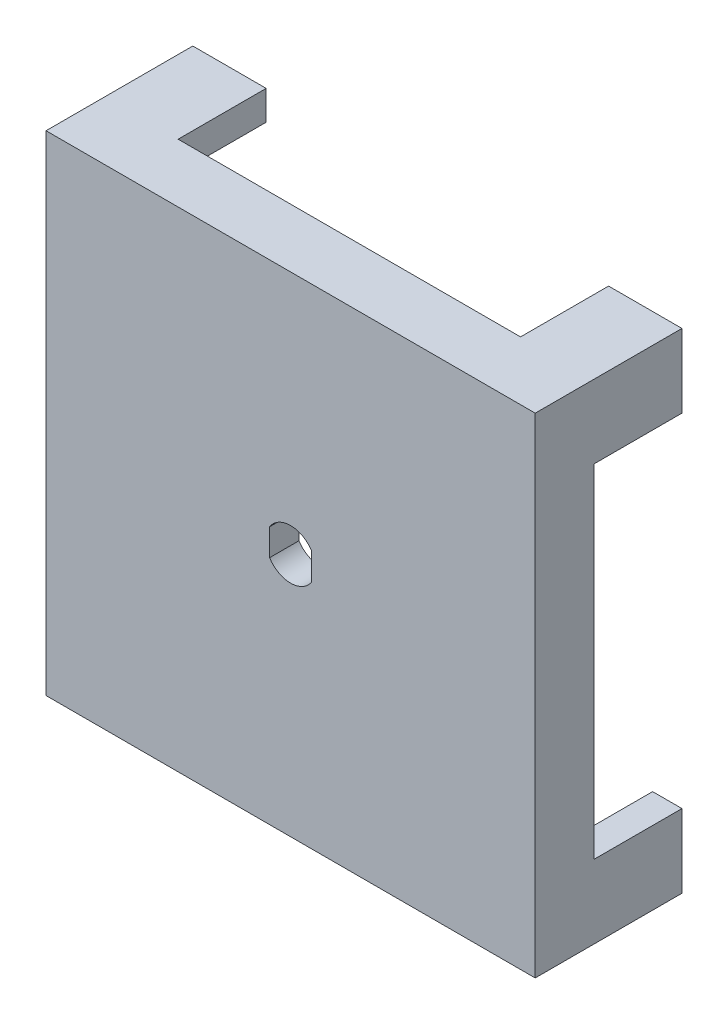
ISO-10303-21;
HEADER;
FILE_DESCRIPTION(('STEP AP214'),'2;1');
FILE_NAME('part.step','',(''),(''),'','','');
FILE_SCHEMA(('AUTOMOTIVE_DESIGN { 1 0 10303 214 1 1 1 1 }'));
ENDSEC;
DATA;
#1=APPLICATION_CONTEXT('core data for automotive mechanical design processes');
#2=APPLICATION_PROTOCOL_DEFINITION('international standard','automotive_design',2000,#1);
#3=PRODUCT_CONTEXT('',#1,'mechanical');
#4=PRODUCT('Part','Part','',(#3));
#5=PRODUCT_RELATED_PRODUCT_CATEGORY('part','',(#4));
#6=PRODUCT_DEFINITION_FORMATION('','',#4);
#7=PRODUCT_DEFINITION_CONTEXT('part definition',#1,'design');
#8=PRODUCT_DEFINITION('design','',#6,#7);
#9=PRODUCT_DEFINITION_SHAPE('','',#8);
#10=(LENGTH_UNIT() NAMED_UNIT(*) SI_UNIT(.MILLI.,.METRE.));
#11=(NAMED_UNIT(*) PLANE_ANGLE_UNIT() SI_UNIT($,.RADIAN.));
#12=(NAMED_UNIT(*) SI_UNIT($,.STERADIAN.) SOLID_ANGLE_UNIT());
#13=UNCERTAINTY_MEASURE_WITH_UNIT(LENGTH_MEASURE(1.E-05),#10,'distance_accuracy_value','');
#14=(GEOMETRIC_REPRESENTATION_CONTEXT(3) GLOBAL_UNCERTAINTY_ASSIGNED_CONTEXT((#13)) GLOBAL_UNIT_ASSIGNED_CONTEXT((#10,
#11,#12)) REPRESENTATION_CONTEXT('',''));
#15=CARTESIAN_POINT('',(0.,0.,0.));
#16=DIRECTION('',(0.,0.,1.));
#17=DIRECTION('',(1.,0.,0.));
#18=AXIS2_PLACEMENT_3D('',#15,#16,#17);
#19=CARTESIAN_POINT('',(0.,0.,0.));
#20=DIRECTION('',(0.,0.,-1.));
#21=DIRECTION('',(-1.,0.,0.));
#22=AXIS2_PLACEMENT_3D('',#19,#20,#21);
#23=PLANE('',#22);
#24=DIRECTION('',(1.,0.,0.));
#25=VECTOR('',#24,1.);
#26=CARTESIAN_POINT('',(17.5,17.5,0.));
#27=LINE('',#26,#25);
#28=CARTESIAN_POINT('',(22.,17.5,0.));
#29=VERTEX_POINT('',#28);
#30=CARTESIAN_POINT('',(25.,17.5,0.));
#31=VERTEX_POINT('',#30);
#32=EDGE_CURVE('E224',#29,#31,#27,.T.);
#33=ORIENTED_EDGE('',*,*,#32,.F.);
#34=DIRECTION('',(0.,1.,0.));
#35=VECTOR('',#34,1.);
#36=CARTESIAN_POINT('',(22.,0.,0.));
#37=LINE('',#36,#35);
#38=CARTESIAN_POINT('',(22.,22.,0.));
#39=VERTEX_POINT('',#38);
#40=EDGE_CURVE('E234',#29,#39,#37,.T.);
#41=ORIENTED_EDGE('',*,*,#40,.T.);
#42=DIRECTION('',(-1.,0.,0.));
#43=VECTOR('',#42,1.);
#44=CARTESIAN_POINT('',(0.,22.,0.));
#45=LINE('',#44,#43);
#46=CARTESIAN_POINT('',(17.5,22.,0.));
#47=VERTEX_POINT('',#46);
#48=EDGE_CURVE('E266',#39,#47,#45,.T.);
#49=ORIENTED_EDGE('',*,*,#48,.T.);
#50=DIRECTION('',(0.,-1.,0.));
#51=VECTOR('',#50,1.);
#52=CARTESIAN_POINT('',(17.5,17.5,0.));
#53=LINE('',#52,#51);
#54=CARTESIAN_POINT('',(17.5,25.,0.));
#55=VERTEX_POINT('',#54);
#56=EDGE_CURVE('E460',#55,#47,#53,.T.);
#57=ORIENTED_EDGE('',*,*,#56,.F.);
#58=DIRECTION('',(-1.,0.,0.));
#59=VECTOR('',#58,1.);
#60=CARTESIAN_POINT('',(-25.,25.,0.));
#61=LINE('',#60,#59);
#62=CARTESIAN_POINT('',(25.,25.,0.));
#63=VERTEX_POINT('',#62);
#64=EDGE_CURVE('E283',#63,#55,#61,.T.);
#65=ORIENTED_EDGE('',*,*,#64,.F.);
#66=DIRECTION('',(0.,1.,0.));
#67=VECTOR('',#66,1.);
#68=CARTESIAN_POINT('',(25.,-25.,0.));
#69=LINE('',#68,#67);
#70=EDGE_CURVE('E237',#31,#63,#69,.T.);
#71=ORIENTED_EDGE('',*,*,#70,.F.);
#72=EDGE_LOOP('',(#33,#41,#49,#57,#65,#71));
#73=FACE_BOUND('',#72,.T.);
#74=ADVANCED_FACE('F38',(#73),#23,.T.);
#75=DIRECTION('',(0.,1.,0.));
#76=VECTOR('',#75,1.);
#77=CARTESIAN_POINT('',(-17.5,17.5,0.));
#78=LINE('',#77,#76);
#79=CARTESIAN_POINT('',(-17.5,22.,0.));
#80=VERTEX_POINT('',#79);
#81=CARTESIAN_POINT('',(-17.5,25.,0.));
#82=VERTEX_POINT('',#81);
#83=EDGE_CURVE('E436',#80,#82,#78,.T.);
#84=ORIENTED_EDGE('',*,*,#83,.F.);
#85=CARTESIAN_POINT('',(-22.,22.,0.));
#86=VERTEX_POINT('',#85);
#87=EDGE_CURVE('E249',#80,#86,#45,.T.);
#88=ORIENTED_EDGE('',*,*,#87,.T.);
#89=DIRECTION('',(0.,-1.,0.));
#90=VECTOR('',#89,1.);
#91=CARTESIAN_POINT('',(-22.,0.,0.));
#92=LINE('',#91,#90);
#93=CARTESIAN_POINT('',(-22.,17.5,0.));
#94=VERTEX_POINT('',#93);
#95=EDGE_CURVE('E262',#86,#94,#92,.T.);
#96=ORIENTED_EDGE('',*,*,#95,.T.);
#97=DIRECTION('',(1.,0.,0.));
#98=VECTOR('',#97,1.);
#99=CARTESIAN_POINT('',(-26.9414519116129,17.5,0.));
#100=LINE('',#99,#98);
#101=CARTESIAN_POINT('',(-25.,17.5,0.));
#102=VERTEX_POINT('',#101);
#103=EDGE_CURVE('E434',#102,#94,#100,.T.);
#104=ORIENTED_EDGE('',*,*,#103,.F.);
#105=DIRECTION('',(0.,-1.,0.));
#106=VECTOR('',#105,1.);
#107=CARTESIAN_POINT('',(-25.,-25.,0.));
#108=LINE('',#107,#106);
#109=CARTESIAN_POINT('',(-25.,25.,0.));
#110=VERTEX_POINT('',#109);
#111=EDGE_CURVE('E287',#110,#102,#108,.T.);
#112=ORIENTED_EDGE('',*,*,#111,.F.);
#113=EDGE_CURVE('E282',#82,#110,#61,.T.);
#114=ORIENTED_EDGE('',*,*,#113,.F.);
#115=EDGE_LOOP('',(#84,#88,#96,#104,#112,#114));
#116=FACE_BOUND('',#115,.T.);
#117=ADVANCED_FACE('F432',(#116),#23,.T.);
#118=DIRECTION('',(-1.,0.,0.));
#119=VECTOR('',#118,1.);
#120=CARTESIAN_POINT('',(-26.9414519116129,-17.5,0.));
#121=LINE('',#120,#119);
#122=CARTESIAN_POINT('',(-22.,-17.5,0.));
#123=VERTEX_POINT('',#122);
#124=CARTESIAN_POINT('',(-25.,-17.5,0.));
#125=VERTEX_POINT('',#124);
#126=EDGE_CURVE('E456',#123,#125,#121,.T.);
#127=ORIENTED_EDGE('',*,*,#126,.F.);
#128=CARTESIAN_POINT('',(-22.,-22.,0.));
#129=VERTEX_POINT('',#128);
#130=EDGE_CURVE('E265',#123,#129,#92,.T.);
#131=ORIENTED_EDGE('',*,*,#130,.T.);
#132=DIRECTION('',(1.,0.,0.));
#133=VECTOR('',#132,1.);
#134=CARTESIAN_POINT('',(0.,-22.,0.));
#135=LINE('',#134,#133);
#136=CARTESIAN_POINT('',(-17.5,-22.,0.));
#137=VERTEX_POINT('',#136);
#138=EDGE_CURVE('E257',#129,#137,#135,.T.);
#139=ORIENTED_EDGE('',*,*,#138,.T.);
#140=DIRECTION('',(0.,1.,0.));
#141=VECTOR('',#140,1.);
#142=CARTESIAN_POINT('',(-17.5,-27.9483997174268,0.));
#143=LINE('',#142,#141);
#144=CARTESIAN_POINT('',(-17.5,-25.,0.));
#145=VERTEX_POINT('',#144);
#146=EDGE_CURVE('E454',#145,#137,#143,.T.);
#147=ORIENTED_EDGE('',*,*,#146,.F.);
#148=DIRECTION('',(1.,0.,0.));
#149=VECTOR('',#148,1.);
#150=CARTESIAN_POINT('',(-25.,-25.,0.));
#151=LINE('',#150,#149);
#152=CARTESIAN_POINT('',(-25.,-25.,0.));
#153=VERTEX_POINT('',#152);
#154=EDGE_CURVE('E272',#153,#145,#151,.T.);
#155=ORIENTED_EDGE('',*,*,#154,.F.);
#156=EDGE_CURVE('E286',#125,#153,#108,.T.);
#157=ORIENTED_EDGE('',*,*,#156,.F.);
#158=EDGE_LOOP('',(#127,#131,#139,#147,#155,#157));
#159=FACE_BOUND('',#158,.T.);
#160=ADVANCED_FACE('F473',(#159),#23,.T.);
#161=DIRECTION('',(0.,-1.,0.));
#162=VECTOR('',#161,1.);
#163=CARTESIAN_POINT('',(17.5,-27.9483997174268,0.));
#164=LINE('',#163,#162);
#165=CARTESIAN_POINT('',(17.5,-22.,0.));
#166=VERTEX_POINT('',#165);
#167=CARTESIAN_POINT('',(17.5,-25.,0.));
#168=VERTEX_POINT('',#167);
#169=EDGE_CURVE('E452',#166,#168,#164,.T.);
#170=ORIENTED_EDGE('',*,*,#169,.F.);
#171=CARTESIAN_POINT('',(22.,-22.,0.));
#172=VERTEX_POINT('',#171);
#173=EDGE_CURVE('E261',#166,#172,#135,.T.);
#174=ORIENTED_EDGE('',*,*,#173,.T.);
#175=CARTESIAN_POINT('',(22.,-17.5,0.));
#176=VERTEX_POINT('',#175);
#177=EDGE_CURVE('E245',#172,#176,#37,.T.);
#178=ORIENTED_EDGE('',*,*,#177,.T.);
#179=DIRECTION('',(-1.,0.,0.));
#180=VECTOR('',#179,1.);
#181=CARTESIAN_POINT('',(17.5,-17.5,0.));
#182=LINE('',#181,#180);
#183=CARTESIAN_POINT('',(25.,-17.5,0.));
#184=VERTEX_POINT('',#183);
#185=EDGE_CURVE('E238',#184,#176,#182,.T.);
#186=ORIENTED_EDGE('',*,*,#185,.F.);
#187=CARTESIAN_POINT('',(25.,-25.,0.));
#188=VERTEX_POINT('',#187);
#189=EDGE_CURVE('E279',#188,#184,#69,.T.);
#190=ORIENTED_EDGE('',*,*,#189,.F.);
#191=EDGE_CURVE('E290',#168,#188,#151,.T.);
#192=ORIENTED_EDGE('',*,*,#191,.F.);
#193=EDGE_LOOP('',(#170,#174,#178,#186,#190,#192));
#194=FACE_BOUND('',#193,.T.);
#195=ADVANCED_FACE('F495',(#194),#23,.T.);
#196=CARTESIAN_POINT('',(25.,-25.,15.));
#197=DIRECTION('',(-1.,0.,0.));
#198=DIRECTION('',(0.,0.,1.));
#199=AXIS2_PLACEMENT_3D('',#196,#197,#198);
#200=PLANE('',#199);
#201=DIRECTION('',(0.,1.,0.));
#202=VECTOR('',#201,1.);
#203=CARTESIAN_POINT('',(25.,-25.,9.));
#204=LINE('',#203,#202);
#205=CARTESIAN_POINT('',(25.,-17.5,9.));
#206=VERTEX_POINT('',#205);
#207=CARTESIAN_POINT('',(25.,17.5,9.));
#208=VERTEX_POINT('',#207);
#209=EDGE_CURVE('E350',#206,#208,#204,.T.);
#210=ORIENTED_EDGE('',*,*,#209,.T.);
#211=DIRECTION('',(0.,0.,-1.));
#212=VECTOR('',#211,1.);
#213=CARTESIAN_POINT('',(25.,17.5,15.));
#214=LINE('',#213,#212);
#215=EDGE_CURVE('E373',#208,#31,#214,.T.);
#216=ORIENTED_EDGE('',*,*,#215,.T.);
#217=ORIENTED_EDGE('',*,*,#70,.T.);
#218=DIRECTION('',(0.,0.,-1.));
#219=VECTOR('',#218,1.);
#220=CARTESIAN_POINT('',(25.,25.,15.));
#221=LINE('',#220,#219);
#222=CARTESIAN_POINT('',(25.,25.,15.));
#223=VERTEX_POINT('',#222);
#224=EDGE_CURVE('E301',#223,#63,#221,.T.);
#225=ORIENTED_EDGE('',*,*,#224,.F.);
#226=DIRECTION('',(0.,1.,0.));
#227=VECTOR('',#226,1.);
#228=CARTESIAN_POINT('',(25.,-25.,15.));
#229=LINE('',#228,#227);
#230=CARTESIAN_POINT('',(25.,-25.,15.));
#231=VERTEX_POINT('',#230);
#232=EDGE_CURVE('E268',#231,#223,#229,.T.);
#233=ORIENTED_EDGE('',*,*,#232,.F.);
#234=DIRECTION('',(0.,0.,-1.));
#235=VECTOR('',#234,1.);
#236=CARTESIAN_POINT('',(25.,-25.,15.));
#237=LINE('',#236,#235);
#238=EDGE_CURVE('E278',#231,#188,#237,.T.);
#239=ORIENTED_EDGE('',*,*,#238,.T.);
#240=ORIENTED_EDGE('',*,*,#189,.T.);
#241=DIRECTION('',(0.,0.,1.));
#242=VECTOR('',#241,1.);
#243=CARTESIAN_POINT('',(25.,-17.5,15.));
#244=LINE('',#243,#242);
#245=EDGE_CURVE('E371',#184,#206,#244,.T.);
#246=ORIENTED_EDGE('',*,*,#245,.T.);
#247=EDGE_LOOP('',(#210,#216,#217,#225,#233,#239,#240,#246));
#248=FACE_BOUND('',#247,.T.);
#249=ADVANCED_FACE('F40',(#248),#200,.F.);
#250=CARTESIAN_POINT('',(-25.,25.,15.));
#251=DIRECTION('',(0.,-1.,0.));
#252=DIRECTION('',(0.,0.,-1.));
#253=AXIS2_PLACEMENT_3D('',#250,#251,#252);
#254=PLANE('',#253);
#255=ORIENTED_EDGE('',*,*,#64,.T.);
#256=DIRECTION('',(0.,0.,1.));
#257=VECTOR('',#256,1.);
#258=CARTESIAN_POINT('',(17.5,25.,15.));
#259=LINE('',#258,#257);
#260=CARTESIAN_POINT('',(17.5,25.,9.));
#261=VERTEX_POINT('',#260);
#262=EDGE_CURVE('E368',#55,#261,#259,.T.);
#263=ORIENTED_EDGE('',*,*,#262,.T.);
#264=DIRECTION('',(-1.,0.,0.));
#265=VECTOR('',#264,1.);
#266=CARTESIAN_POINT('',(-25.,25.,9.));
#267=LINE('',#266,#265);
#268=CARTESIAN_POINT('',(-17.5,25.,9.));
#269=VERTEX_POINT('',#268);
#270=EDGE_CURVE('E347',#261,#269,#267,.T.);
#271=ORIENTED_EDGE('',*,*,#270,.T.);
#272=DIRECTION('',(0.,0.,-1.));
#273=VECTOR('',#272,1.);
#274=CARTESIAN_POINT('',(-17.5,25.,15.));
#275=LINE('',#274,#273);
#276=EDGE_CURVE('E365',#269,#82,#275,.T.);
#277=ORIENTED_EDGE('',*,*,#276,.T.);
#278=ORIENTED_EDGE('',*,*,#113,.T.);
#279=DIRECTION('',(0.,0.,-1.));
#280=VECTOR('',#279,1.);
#281=CARTESIAN_POINT('',(-25.,25.,15.));
#282=LINE('',#281,#280);
#283=CARTESIAN_POINT('',(-25.,25.,15.));
#284=VERTEX_POINT('',#283);
#285=EDGE_CURVE('E298',#284,#110,#282,.T.);
#286=ORIENTED_EDGE('',*,*,#285,.F.);
#287=DIRECTION('',(-1.,0.,0.));
#288=VECTOR('',#287,1.);
#289=CARTESIAN_POINT('',(-25.,25.,15.));
#290=LINE('',#289,#288);
#291=EDGE_CURVE('E271',#223,#284,#290,.T.);
#292=ORIENTED_EDGE('',*,*,#291,.F.);
#293=ORIENTED_EDGE('',*,*,#224,.T.);
#294=EDGE_LOOP('',(#255,#263,#271,#277,#278,#286,#292,#293));
#295=FACE_BOUND('',#294,.T.);
#296=ADVANCED_FACE('F507',(#295),#254,.F.);
#297=CARTESIAN_POINT('',(-25.,-25.,15.));
#298=DIRECTION('',(1.,0.,0.));
#299=DIRECTION('',(0.,0.,-1.));
#300=AXIS2_PLACEMENT_3D('',#297,#298,#299);
#301=PLANE('',#300);
#302=ORIENTED_EDGE('',*,*,#111,.T.);
#303=DIRECTION('',(0.,0.,1.));
#304=VECTOR('',#303,1.);
#305=CARTESIAN_POINT('',(-25.,17.5,15.));
#306=LINE('',#305,#304);
#307=CARTESIAN_POINT('',(-25.,17.5,9.));
#308=VERTEX_POINT('',#307);
#309=EDGE_CURVE('E362',#102,#308,#306,.T.);
#310=ORIENTED_EDGE('',*,*,#309,.T.);
#311=DIRECTION('',(0.,-1.,0.));
#312=VECTOR('',#311,1.);
#313=CARTESIAN_POINT('',(-25.,-25.,9.));
#314=LINE('',#313,#312);
#315=CARTESIAN_POINT('',(-25.,-17.5,9.));
#316=VERTEX_POINT('',#315);
#317=EDGE_CURVE('E339',#308,#316,#314,.T.);
#318=ORIENTED_EDGE('',*,*,#317,.T.);
#319=DIRECTION('',(0.,0.,-1.));
#320=VECTOR('',#319,1.);
#321=CARTESIAN_POINT('',(-25.,-17.5,15.));
#322=LINE('',#321,#320);
#323=EDGE_CURVE('E359',#316,#125,#322,.T.);
#324=ORIENTED_EDGE('',*,*,#323,.T.);
#325=ORIENTED_EDGE('',*,*,#156,.T.);
#326=DIRECTION('',(0.,0.,-1.));
#327=VECTOR('',#326,1.);
#328=CARTESIAN_POINT('',(-25.,-25.,15.));
#329=LINE('',#328,#327);
#330=CARTESIAN_POINT('',(-25.,-25.,15.));
#331=VERTEX_POINT('',#330);
#332=EDGE_CURVE('E295',#331,#153,#329,.T.);
#333=ORIENTED_EDGE('',*,*,#332,.F.);
#334=DIRECTION('',(0.,-1.,0.));
#335=VECTOR('',#334,1.);
#336=CARTESIAN_POINT('',(-25.,-25.,15.));
#337=LINE('',#336,#335);
#338=EDGE_CURVE('E274',#284,#331,#337,.T.);
#339=ORIENTED_EDGE('',*,*,#338,.F.);
#340=ORIENTED_EDGE('',*,*,#285,.T.);
#341=EDGE_LOOP('',(#302,#310,#318,#324,#325,#333,#339,#340));
#342=FACE_BOUND('',#341,.T.);
#343=ADVANCED_FACE('F478',(#342),#301,.F.);
#344=CARTESIAN_POINT('',(-25.,-25.,15.));
#345=DIRECTION('',(0.,1.,0.));
#346=DIRECTION('',(0.,0.,1.));
#347=AXIS2_PLACEMENT_3D('',#344,#345,#346);
#348=PLANE('',#347);
#349=ORIENTED_EDGE('',*,*,#154,.T.);
#350=DIRECTION('',(0.,0.,1.));
#351=VECTOR('',#350,1.);
#352=CARTESIAN_POINT('',(-17.5,-25.,15.));
#353=LINE('',#352,#351);
#354=CARTESIAN_POINT('',(-17.5,-25.,9.));
#355=VERTEX_POINT('',#354);
#356=EDGE_CURVE('E356',#145,#355,#353,.T.);
#357=ORIENTED_EDGE('',*,*,#356,.T.);
#358=DIRECTION('',(1.,0.,0.));
#359=VECTOR('',#358,1.);
#360=CARTESIAN_POINT('',(-25.,-25.,9.));
#361=LINE('',#360,#359);
#362=CARTESIAN_POINT('',(17.5,-25.,9.));
#363=VERTEX_POINT('',#362);
#364=EDGE_CURVE('E335',#355,#363,#361,.T.);
#365=ORIENTED_EDGE('',*,*,#364,.T.);
#366=DIRECTION('',(0.,0.,-1.));
#367=VECTOR('',#366,1.);
#368=CARTESIAN_POINT('',(17.5,-25.,15.));
#369=LINE('',#368,#367);
#370=EDGE_CURVE('E353',#363,#168,#369,.T.);
#371=ORIENTED_EDGE('',*,*,#370,.T.);
#372=ORIENTED_EDGE('',*,*,#191,.T.);
#373=ORIENTED_EDGE('',*,*,#238,.F.);
#374=DIRECTION('',(1.,0.,0.));
#375=VECTOR('',#374,1.);
#376=CARTESIAN_POINT('',(-25.,-25.,15.));
#377=LINE('',#376,#375);
#378=EDGE_CURVE('E276',#331,#231,#377,.T.);
#379=ORIENTED_EDGE('',*,*,#378,.F.);
#380=ORIENTED_EDGE('',*,*,#332,.T.);
#381=EDGE_LOOP('',(#349,#357,#365,#371,#372,#373,#379,#380));
#382=FACE_BOUND('',#381,.T.);
#383=ADVANCED_FACE('F529',(#382),#348,.F.);
#384=CARTESIAN_POINT('',(0.,0.,15.));
#385=DIRECTION('',(0.,0.,-1.));
#386=DIRECTION('',(-1.,0.,0.));
#387=AXIS2_PLACEMENT_3D('',#384,#385,#386);
#388=PLANE('',#387);
#389=DIRECTION('',(0.,1.,0.));
#390=VECTOR('',#389,1.);
#391=CARTESIAN_POINT('',(-2.15,1.37113092008021,15.));
#392=LINE('',#391,#390);
#393=CARTESIAN_POINT('',(-2.15,-1.37113092008021,15.));
#394=VERTEX_POINT('',#393);
#395=CARTESIAN_POINT('',(-2.15,1.37113092008021,15.));
#396=VERTEX_POINT('',#395);
#397=EDGE_CURVE('E384',#394,#396,#392,.T.);
#398=ORIENTED_EDGE('',*,*,#397,.T.);
#399=CARTESIAN_POINT('',(0.,0.,15.));
#400=DIRECTION('',(0.,0.,-1.));
#401=DIRECTION('',(-1.,0.,0.));
#402=AXIS2_PLACEMENT_3D('',#399,#400,#401);
#403=CIRCLE('',#402,2.55);
#404=CARTESIAN_POINT('',(2.15,1.37113092008021,15.));
#405=VERTEX_POINT('',#404);
#406=EDGE_CURVE('E375',#396,#405,#403,.T.);
#407=ORIENTED_EDGE('',*,*,#406,.T.);
#408=DIRECTION('',(0.,-1.,0.));
#409=VECTOR('',#408,1.);
#410=CARTESIAN_POINT('',(2.15,1.37113092008021,15.));
#411=LINE('',#410,#409);
#412=CARTESIAN_POINT('',(2.15,-1.37113092008021,15.));
#413=VERTEX_POINT('',#412);
#414=EDGE_CURVE('E378',#405,#413,#411,.T.);
#415=ORIENTED_EDGE('',*,*,#414,.T.);
#416=CARTESIAN_POINT('',(0.,0.,15.));
#417=DIRECTION('',(0.,0.,-1.));
#418=DIRECTION('',(-1.,0.,0.));
#419=AXIS2_PLACEMENT_3D('',#416,#417,#418);
#420=CIRCLE('',#419,2.55);
#421=EDGE_CURVE('E381',#413,#394,#420,.T.);
#422=ORIENTED_EDGE('',*,*,#421,.T.);
#423=EDGE_LOOP('',(#398,#407,#415,#422));
#424=FACE_BOUND('',#423,.T.);
#425=ORIENTED_EDGE('',*,*,#232,.T.);
#426=ORIENTED_EDGE('',*,*,#291,.T.);
#427=ORIENTED_EDGE('',*,*,#338,.T.);
#428=ORIENTED_EDGE('',*,*,#378,.T.);
#429=EDGE_LOOP('',(#425,#426,#427,#428));
#430=FACE_BOUND('',#429,.T.);
#431=ADVANCED_FACE('F537',(#424,#430),#388,.F.);
#432=CARTESIAN_POINT('',(22.,-25.,15.));
#433=DIRECTION('',(-1.,0.,0.));
#434=DIRECTION('',(0.,0.,1.));
#435=AXIS2_PLACEMENT_3D('',#432,#433,#434);
#436=PLANE('',#435);
#437=DIRECTION('',(0.,0.,-1.));
#438=VECTOR('',#437,1.);
#439=CARTESIAN_POINT('',(22.,17.5,15.));
#440=LINE('',#439,#438);
#441=CARTESIAN_POINT('',(22.,17.5,9.));
#442=VERTEX_POINT('',#441);
#443=EDGE_CURVE('E11',#442,#29,#440,.T.);
#444=ORIENTED_EDGE('',*,*,#443,.F.);
#445=DIRECTION('',(0.,1.,0.));
#446=VECTOR('',#445,1.);
#447=CARTESIAN_POINT('',(22.,-25.,9.));
#448=LINE('',#447,#446);
#449=CARTESIAN_POINT('',(22.,-17.5,9.));
#450=VERTEX_POINT('',#449);
#451=EDGE_CURVE('E334',#450,#442,#448,.T.);
#452=ORIENTED_EDGE('',*,*,#451,.F.);
#453=DIRECTION('',(0.,0.,1.));
#454=VECTOR('',#453,1.);
#455=CARTESIAN_POINT('',(22.,-17.5,15.));
#456=LINE('',#455,#454);
#457=EDGE_CURVE('E46',#176,#450,#456,.T.);
#458=ORIENTED_EDGE('',*,*,#457,.F.);
#459=ORIENTED_EDGE('',*,*,#177,.F.);
#460=DIRECTION('',(0.,0.,-1.));
#461=VECTOR('',#460,1.);
#462=CARTESIAN_POINT('',(22.,-22.,15.));
#463=LINE('',#462,#461);
#464=CARTESIAN_POINT('',(22.,-22.,12.));
#465=VERTEX_POINT('',#464);
#466=EDGE_CURVE('E398',#465,#172,#463,.T.);
#467=ORIENTED_EDGE('',*,*,#466,.F.);
#468=DIRECTION('',(0.,1.,0.));
#469=VECTOR('',#468,1.);
#470=CARTESIAN_POINT('',(22.,0.,12.));
#471=LINE('',#470,#469);
#472=CARTESIAN_POINT('',(22.,22.,12.));
#473=VERTEX_POINT('',#472);
#474=EDGE_CURVE('E260',#465,#473,#471,.T.);
#475=ORIENTED_EDGE('',*,*,#474,.T.);
#476=DIRECTION('',(0.,0.,-1.));
#477=VECTOR('',#476,1.);
#478=CARTESIAN_POINT('',(22.,22.,15.));
#479=LINE('',#478,#477);
#480=EDGE_CURVE('E244',#473,#39,#479,.T.);
#481=ORIENTED_EDGE('',*,*,#480,.T.);
#482=ORIENTED_EDGE('',*,*,#40,.F.);
#483=EDGE_LOOP('',(#444,#452,#458,#459,#467,#475,#481,#482));
#484=FACE_BOUND('',#483,.T.);
#485=ADVANCED_FACE('F241',(#484),#436,.T.);
#486=CARTESIAN_POINT('',(-25.,22.,15.));
#487=DIRECTION('',(0.,-1.,0.));
#488=DIRECTION('',(0.,0.,-1.));
#489=AXIS2_PLACEMENT_3D('',#486,#487,#488);
#490=PLANE('',#489);
#491=DIRECTION('',(0.,0.,1.));
#492=VECTOR('',#491,1.);
#493=CARTESIAN_POINT('',(17.5,22.,15.));
#494=LINE('',#493,#492);
#495=CARTESIAN_POINT('',(17.5,22.,9.));
#496=VERTEX_POINT('',#495);
#497=EDGE_CURVE('E327',#47,#496,#494,.T.);
#498=ORIENTED_EDGE('',*,*,#497,.F.);
#499=ORIENTED_EDGE('',*,*,#48,.F.);
#500=ORIENTED_EDGE('',*,*,#480,.F.);
#501=DIRECTION('',(-1.,0.,0.));
#502=VECTOR('',#501,1.);
#503=CARTESIAN_POINT('',(0.,22.,12.));
#504=LINE('',#503,#502);
#505=CARTESIAN_POINT('',(-22.,22.,12.));
#506=VERTEX_POINT('',#505);
#507=EDGE_CURVE('E397',#473,#506,#504,.T.);
#508=ORIENTED_EDGE('',*,*,#507,.T.);
#509=DIRECTION('',(0.,0.,-1.));
#510=VECTOR('',#509,1.);
#511=CARTESIAN_POINT('',(-22.,22.,15.));
#512=LINE('',#511,#510);
#513=EDGE_CURVE('E395',#506,#86,#512,.T.);
#514=ORIENTED_EDGE('',*,*,#513,.T.);
#515=ORIENTED_EDGE('',*,*,#87,.F.);
#516=DIRECTION('',(0.,0.,-1.));
#517=VECTOR('',#516,1.);
#518=CARTESIAN_POINT('',(-17.5,22.,15.));
#519=LINE('',#518,#517);
#520=CARTESIAN_POINT('',(-17.5,22.,9.));
#521=VERTEX_POINT('',#520);
#522=EDGE_CURVE('E325',#521,#80,#519,.T.);
#523=ORIENTED_EDGE('',*,*,#522,.F.);
#524=DIRECTION('',(-1.,0.,0.));
#525=VECTOR('',#524,1.);
#526=CARTESIAN_POINT('',(-25.,22.,9.));
#527=LINE('',#526,#525);
#528=EDGE_CURVE('E336',#496,#521,#527,.T.);
#529=ORIENTED_EDGE('',*,*,#528,.F.);
#530=EDGE_LOOP('',(#498,#499,#500,#508,#514,#515,#523,#529));
#531=FACE_BOUND('',#530,.T.);
#532=ADVANCED_FACE('F423',(#531),#490,.T.);
#533=CARTESIAN_POINT('',(-22.,-25.,15.));
#534=DIRECTION('',(1.,0.,0.));
#535=DIRECTION('',(0.,0.,-1.));
#536=AXIS2_PLACEMENT_3D('',#533,#534,#535);
#537=PLANE('',#536);
#538=DIRECTION('',(0.,0.,1.));
#539=VECTOR('',#538,1.);
#540=CARTESIAN_POINT('',(-22.,17.5,15.));
#541=LINE('',#540,#539);
#542=CARTESIAN_POINT('',(-22.,17.5,9.));
#543=VERTEX_POINT('',#542);
#544=EDGE_CURVE('E322',#94,#543,#541,.T.);
#545=ORIENTED_EDGE('',*,*,#544,.F.);
#546=ORIENTED_EDGE('',*,*,#95,.F.);
#547=ORIENTED_EDGE('',*,*,#513,.F.);
#548=DIRECTION('',(0.,-1.,0.));
#549=VECTOR('',#548,1.);
#550=CARTESIAN_POINT('',(-22.,0.,12.));
#551=LINE('',#550,#549);
#552=CARTESIAN_POINT('',(-22.,-22.,12.));
#553=VERTEX_POINT('',#552);
#554=EDGE_CURVE('E405',#506,#553,#551,.T.);
#555=ORIENTED_EDGE('',*,*,#554,.T.);
#556=DIRECTION('',(0.,0.,-1.));
#557=VECTOR('',#556,1.);
#558=CARTESIAN_POINT('',(-22.,-22.,15.));
#559=LINE('',#558,#557);
#560=EDGE_CURVE('E401',#553,#129,#559,.T.);
#561=ORIENTED_EDGE('',*,*,#560,.T.);
#562=ORIENTED_EDGE('',*,*,#130,.F.);
#563=DIRECTION('',(0.,0.,-1.));
#564=VECTOR('',#563,1.);
#565=CARTESIAN_POINT('',(-22.,-17.5,15.));
#566=LINE('',#565,#564);
#567=CARTESIAN_POINT('',(-22.,-17.5,9.));
#568=VERTEX_POINT('',#567);
#569=EDGE_CURVE('E320',#568,#123,#566,.T.);
#570=ORIENTED_EDGE('',*,*,#569,.F.);
#571=DIRECTION('',(0.,-1.,0.));
#572=VECTOR('',#571,1.);
#573=CARTESIAN_POINT('',(-22.,-25.,9.));
#574=LINE('',#573,#572);
#575=EDGE_CURVE('E341',#543,#568,#574,.T.);
#576=ORIENTED_EDGE('',*,*,#575,.F.);
#577=EDGE_LOOP('',(#545,#546,#547,#555,#561,#562,#570,#576));
#578=FACE_BOUND('',#577,.T.);
#579=ADVANCED_FACE('F427',(#578),#537,.T.);
#580=CARTESIAN_POINT('',(-25.,-22.,15.));
#581=DIRECTION('',(0.,1.,0.));
#582=DIRECTION('',(0.,0.,1.));
#583=AXIS2_PLACEMENT_3D('',#580,#581,#582);
#584=PLANE('',#583);
#585=DIRECTION('',(0.,0.,1.));
#586=VECTOR('',#585,1.);
#587=CARTESIAN_POINT('',(-17.5,-22.,15.));
#588=LINE('',#587,#586);
#589=CARTESIAN_POINT('',(-17.5,-22.,9.));
#590=VERTEX_POINT('',#589);
#591=EDGE_CURVE('E317',#137,#590,#588,.T.);
#592=ORIENTED_EDGE('',*,*,#591,.F.);
#593=ORIENTED_EDGE('',*,*,#138,.F.);
#594=ORIENTED_EDGE('',*,*,#560,.F.);
#595=DIRECTION('',(1.,0.,0.));
#596=VECTOR('',#595,1.);
#597=CARTESIAN_POINT('',(0.,-22.,12.));
#598=LINE('',#597,#596);
#599=EDGE_CURVE('E255',#553,#465,#598,.T.);
#600=ORIENTED_EDGE('',*,*,#599,.T.);
#601=ORIENTED_EDGE('',*,*,#466,.T.);
#602=ORIENTED_EDGE('',*,*,#173,.F.);
#603=DIRECTION('',(0.,0.,-1.));
#604=VECTOR('',#603,1.);
#605=CARTESIAN_POINT('',(17.5,-22.,15.));
#606=LINE('',#605,#604);
#607=CARTESIAN_POINT('',(17.5,-22.,9.));
#608=VERTEX_POINT('',#607);
#609=EDGE_CURVE('E315',#608,#166,#606,.T.);
#610=ORIENTED_EDGE('',*,*,#609,.F.);
#611=DIRECTION('',(1.,0.,0.));
#612=VECTOR('',#611,1.);
#613=CARTESIAN_POINT('',(-25.,-22.,9.));
#614=LINE('',#613,#612);
#615=EDGE_CURVE('E313',#590,#608,#614,.T.);
#616=ORIENTED_EDGE('',*,*,#615,.F.);
#617=EDGE_LOOP('',(#592,#593,#594,#600,#601,#602,#610,#616));
#618=FACE_BOUND('',#617,.T.);
#619=ADVANCED_FACE('F415',(#618),#584,.T.);
#620=CARTESIAN_POINT('',(0.,0.,12.));
#621=DIRECTION('',(0.,0.,-1.));
#622=DIRECTION('',(-1.,0.,0.));
#623=AXIS2_PLACEMENT_3D('',#620,#621,#622);
#624=PLANE('',#623);
#625=CARTESIAN_POINT('',(0.,0.,12.));
#626=DIRECTION('',(0.,0.,-1.));
#627=DIRECTION('',(-1.,0.,0.));
#628=AXIS2_PLACEMENT_3D('',#625,#626,#627);
#629=CIRCLE('',#628,2.55);
#630=CARTESIAN_POINT('',(-2.15,1.37113092008021,12.));
#631=VERTEX_POINT('',#630);
#632=CARTESIAN_POINT('',(2.15,1.37113092008021,12.));
#633=VERTEX_POINT('',#632);
#634=EDGE_CURVE('E310',#631,#633,#629,.T.);
#635=ORIENTED_EDGE('',*,*,#634,.F.);
#636=DIRECTION('',(0.,1.,0.));
#637=VECTOR('',#636,1.);
#638=CARTESIAN_POINT('',(-2.15,0.,12.));
#639=LINE('',#638,#637);
#640=CARTESIAN_POINT('',(-2.15,-1.37113092008021,12.));
#641=VERTEX_POINT('',#640);
#642=EDGE_CURVE('E308',#641,#631,#639,.T.);
#643=ORIENTED_EDGE('',*,*,#642,.F.);
#644=CARTESIAN_POINT('',(0.,0.,12.));
#645=DIRECTION('',(0.,0.,-1.));
#646=DIRECTION('',(-1.,0.,0.));
#647=AXIS2_PLACEMENT_3D('',#644,#645,#646);
#648=CIRCLE('',#647,2.55);
#649=CARTESIAN_POINT('',(2.15,-1.37113092008021,12.));
#650=VERTEX_POINT('',#649);
#651=EDGE_CURVE('E306',#650,#641,#648,.T.);
#652=ORIENTED_EDGE('',*,*,#651,.F.);
#653=DIRECTION('',(0.,-1.,0.));
#654=VECTOR('',#653,1.);
#655=CARTESIAN_POINT('',(2.15,0.,12.));
#656=LINE('',#655,#654);
#657=EDGE_CURVE('E304',#633,#650,#656,.T.);
#658=ORIENTED_EDGE('',*,*,#657,.F.);
#659=EDGE_LOOP('',(#635,#643,#652,#658));
#660=FACE_BOUND('',#659,.T.);
#661=ORIENTED_EDGE('',*,*,#474,.F.);
#662=ORIENTED_EDGE('',*,*,#599,.F.);
#663=ORIENTED_EDGE('',*,*,#554,.F.);
#664=ORIENTED_EDGE('',*,*,#507,.F.);
#665=EDGE_LOOP('',(#661,#662,#663,#664));
#666=FACE_BOUND('',#665,.T.);
#667=ADVANCED_FACE('F420',(#660,#666),#624,.T.);
#668=CARTESIAN_POINT('',(0.,0.,15.));
#669=DIRECTION('',(0.,0.,-1.));
#670=DIRECTION('',(-1.,0.,0.));
#671=AXIS2_PLACEMENT_3D('',#668,#669,#670);
#672=CYLINDRICAL_SURFACE('',#671,2.55);
#673=ORIENTED_EDGE('',*,*,#634,.T.);
#674=DIRECTION('',(0.,0.,-1.));
#675=VECTOR('',#674,1.);
#676=CARTESIAN_POINT('',(2.15,1.37113092008021,15.));
#677=LINE('',#676,#675);
#678=EDGE_CURVE('E387',#405,#633,#677,.T.);
#679=ORIENTED_EDGE('',*,*,#678,.F.);
#680=ORIENTED_EDGE('',*,*,#406,.F.);
#681=DIRECTION('',(0.,0.,-1.));
#682=VECTOR('',#681,1.);
#683=CARTESIAN_POINT('',(-2.15,1.37113092008021,15.));
#684=LINE('',#683,#682);
#685=EDGE_CURVE('E246',#396,#631,#684,.T.);
#686=ORIENTED_EDGE('',*,*,#685,.T.);
#687=EDGE_LOOP('',(#673,#679,#680,#686));
#688=FACE_BOUND('',#687,.T.);
#689=ADVANCED_FACE('F575',(#688),#672,.F.);
#690=CARTESIAN_POINT('',(-2.15,1.37113092008021,15.));
#691=DIRECTION('',(-1.,0.,0.));
#692=DIRECTION('',(0.,0.,1.));
#693=AXIS2_PLACEMENT_3D('',#690,#691,#692);
#694=PLANE('',#693);
#695=ORIENTED_EDGE('',*,*,#642,.T.);
#696=ORIENTED_EDGE('',*,*,#685,.F.);
#697=ORIENTED_EDGE('',*,*,#397,.F.);
#698=DIRECTION('',(0.,0.,-1.));
#699=VECTOR('',#698,1.);
#700=CARTESIAN_POINT('',(-2.15,-1.37113092008021,15.));
#701=LINE('',#700,#699);
#702=EDGE_CURVE('E251',#394,#641,#701,.T.);
#703=ORIENTED_EDGE('',*,*,#702,.T.);
#704=EDGE_LOOP('',(#695,#696,#697,#703));
#705=FACE_BOUND('',#704,.T.);
#706=ADVANCED_FACE('F572',(#705),#694,.F.);
#707=CARTESIAN_POINT('',(0.,0.,15.));
#708=DIRECTION('',(0.,0.,-1.));
#709=DIRECTION('',(-1.,0.,0.));
#710=AXIS2_PLACEMENT_3D('',#707,#708,#709);
#711=CYLINDRICAL_SURFACE('',#710,2.55);
#712=ORIENTED_EDGE('',*,*,#651,.T.);
#713=ORIENTED_EDGE('',*,*,#702,.F.);
#714=ORIENTED_EDGE('',*,*,#421,.F.);
#715=DIRECTION('',(0.,0.,-1.));
#716=VECTOR('',#715,1.);
#717=CARTESIAN_POINT('',(2.15,-1.37113092008021,15.));
#718=LINE('',#717,#716);
#719=EDGE_CURVE('E389',#413,#650,#718,.T.);
#720=ORIENTED_EDGE('',*,*,#719,.T.);
#721=EDGE_LOOP('',(#712,#713,#714,#720));
#722=FACE_BOUND('',#721,.T.);
#723=ADVANCED_FACE('F561',(#722),#711,.F.);
#724=CARTESIAN_POINT('',(2.15,1.37113092008021,15.));
#725=DIRECTION('',(1.,0.,0.));
#726=DIRECTION('',(0.,0.,-1.));
#727=AXIS2_PLACEMENT_3D('',#724,#725,#726);
#728=PLANE('',#727);
#729=ORIENTED_EDGE('',*,*,#657,.T.);
#730=ORIENTED_EDGE('',*,*,#719,.F.);
#731=ORIENTED_EDGE('',*,*,#414,.F.);
#732=ORIENTED_EDGE('',*,*,#678,.T.);
#733=EDGE_LOOP('',(#729,#730,#731,#732));
#734=FACE_BOUND('',#733,.T.);
#735=ADVANCED_FACE('F555',(#734),#728,.F.);
#736=CARTESIAN_POINT('',(0.,0.,9.));
#737=DIRECTION('',(0.,0.,1.));
#738=DIRECTION('',(1.,0.,0.));
#739=AXIS2_PLACEMENT_3D('',#736,#737,#738);
#740=PLANE('',#739);
#741=DIRECTION('',(0.,1.,0.));
#742=VECTOR('',#741,1.);
#743=CARTESIAN_POINT('',(-17.5,-27.9483997174268,9.));
#744=LINE('',#743,#742);
#745=EDGE_CURVE('E470',#355,#590,#744,.T.);
#746=ORIENTED_EDGE('',*,*,#745,.T.);
#747=ORIENTED_EDGE('',*,*,#615,.T.);
#748=DIRECTION('',(0.,-1.,0.));
#749=VECTOR('',#748,1.);
#750=CARTESIAN_POINT('',(17.5,-27.9483997174268,9.));
#751=LINE('',#750,#749);
#752=EDGE_CURVE('E518',#608,#363,#751,.T.);
#753=ORIENTED_EDGE('',*,*,#752,.T.);
#754=ORIENTED_EDGE('',*,*,#364,.F.);
#755=EDGE_LOOP('',(#746,#747,#753,#754));
#756=FACE_BOUND('',#755,.T.);
#757=ADVANCED_FACE('F531',(#756),#740,.F.);
#758=CARTESIAN_POINT('',(17.5,-27.9483997174268,9.));
#759=DIRECTION('',(1.,0.,0.));
#760=DIRECTION('',(0.,1.,0.));
#761=AXIS2_PLACEMENT_3D('',#758,#759,#760);
#762=PLANE('',#761);
#763=ORIENTED_EDGE('',*,*,#752,.F.);
#764=ORIENTED_EDGE('',*,*,#609,.T.);
#765=ORIENTED_EDGE('',*,*,#169,.T.);
#766=ORIENTED_EDGE('',*,*,#370,.F.);
#767=EDGE_LOOP('',(#763,#764,#765,#766));
#768=FACE_BOUND('',#767,.T.);
#769=ADVANCED_FACE('F516',(#768),#762,.F.);
#770=CARTESIAN_POINT('',(-17.5,-27.9483997174268,9.));
#771=DIRECTION('',(-1.,0.,0.));
#772=DIRECTION('',(0.,0.,1.));
#773=AXIS2_PLACEMENT_3D('',#770,#771,#772);
#774=PLANE('',#773);
#775=ORIENTED_EDGE('',*,*,#146,.T.);
#776=ORIENTED_EDGE('',*,*,#591,.T.);
#777=ORIENTED_EDGE('',*,*,#745,.F.);
#778=ORIENTED_EDGE('',*,*,#356,.F.);
#779=EDGE_LOOP('',(#775,#776,#777,#778));
#780=FACE_BOUND('',#779,.T.);
#781=ADVANCED_FACE('F533',(#780),#774,.F.);
#782=DIRECTION('',(1.,0.,0.));
#783=VECTOR('',#782,1.);
#784=CARTESIAN_POINT('',(-26.9414519116129,17.5,9.));
#785=LINE('',#784,#783);
#786=EDGE_CURVE('E444',#308,#543,#785,.T.);
#787=ORIENTED_EDGE('',*,*,#786,.T.);
#788=ORIENTED_EDGE('',*,*,#575,.T.);
#789=DIRECTION('',(-1.,0.,0.));
#790=VECTOR('',#789,1.);
#791=CARTESIAN_POINT('',(-26.9414519116129,-17.5,9.));
#792=LINE('',#791,#790);
#793=EDGE_CURVE('E447',#568,#316,#792,.T.);
#794=ORIENTED_EDGE('',*,*,#793,.T.);
#795=ORIENTED_EDGE('',*,*,#317,.F.);
#796=EDGE_LOOP('',(#787,#788,#794,#795));
#797=FACE_BOUND('',#796,.T.);
#798=ADVANCED_FACE('F464',(#797),#740,.F.);
#799=CARTESIAN_POINT('',(-26.9414519116129,-17.5,9.));
#800=DIRECTION('',(0.,-1.,0.));
#801=DIRECTION('',(1.,0.,0.));
#802=AXIS2_PLACEMENT_3D('',#799,#800,#801);
#803=PLANE('',#802);
#804=ORIENTED_EDGE('',*,*,#793,.F.);
#805=ORIENTED_EDGE('',*,*,#569,.T.);
#806=ORIENTED_EDGE('',*,*,#126,.T.);
#807=ORIENTED_EDGE('',*,*,#323,.F.);
#808=EDGE_LOOP('',(#804,#805,#806,#807));
#809=FACE_BOUND('',#808,.T.);
#810=ADVANCED_FACE('F468',(#809),#803,.F.);
#811=CARTESIAN_POINT('',(-26.9414519116129,17.5,9.));
#812=DIRECTION('',(0.,1.,0.));
#813=DIRECTION('',(0.,0.,1.));
#814=AXIS2_PLACEMENT_3D('',#811,#812,#813);
#815=PLANE('',#814);
#816=ORIENTED_EDGE('',*,*,#103,.T.);
#817=ORIENTED_EDGE('',*,*,#544,.T.);
#818=ORIENTED_EDGE('',*,*,#786,.F.);
#819=ORIENTED_EDGE('',*,*,#309,.F.);
#820=EDGE_LOOP('',(#816,#817,#818,#819));
#821=FACE_BOUND('',#820,.T.);
#822=ADVANCED_FACE('F481',(#821),#815,.F.);
#823=DIRECTION('',(0.,-1.,0.));
#824=VECTOR('',#823,1.);
#825=CARTESIAN_POINT('',(17.5,17.5,9.));
#826=LINE('',#825,#824);
#827=EDGE_CURVE('E61',#261,#496,#826,.T.);
#828=ORIENTED_EDGE('',*,*,#827,.T.);
#829=ORIENTED_EDGE('',*,*,#528,.T.);
#830=DIRECTION('',(0.,1.,0.));
#831=VECTOR('',#830,1.);
#832=CARTESIAN_POINT('',(-17.5,17.5,9.));
#833=LINE('',#832,#831);
#834=EDGE_CURVE('E443',#521,#269,#833,.T.);
#835=ORIENTED_EDGE('',*,*,#834,.T.);
#836=ORIENTED_EDGE('',*,*,#270,.F.);
#837=EDGE_LOOP('',(#828,#829,#835,#836));
#838=FACE_BOUND('',#837,.T.);
#839=ADVANCED_FACE('F483',(#838),#740,.F.);
#840=CARTESIAN_POINT('',(-17.5,17.5,9.));
#841=DIRECTION('',(-1.,0.,0.));
#842=DIRECTION('',(0.,0.,1.));
#843=AXIS2_PLACEMENT_3D('',#840,#841,#842);
#844=PLANE('',#843);
#845=ORIENTED_EDGE('',*,*,#834,.F.);
#846=ORIENTED_EDGE('',*,*,#522,.T.);
#847=ORIENTED_EDGE('',*,*,#83,.T.);
#848=ORIENTED_EDGE('',*,*,#276,.F.);
#849=EDGE_LOOP('',(#845,#846,#847,#848));
#850=FACE_BOUND('',#849,.T.);
#851=ADVANCED_FACE('F441',(#850),#844,.F.);
#852=CARTESIAN_POINT('',(17.5,17.5,9.));
#853=DIRECTION('',(1.,0.,0.));
#854=DIRECTION('',(0.,1.,0.));
#855=AXIS2_PLACEMENT_3D('',#852,#853,#854);
#856=PLANE('',#855);
#857=ORIENTED_EDGE('',*,*,#56,.T.);
#858=ORIENTED_EDGE('',*,*,#497,.T.);
#859=ORIENTED_EDGE('',*,*,#827,.F.);
#860=ORIENTED_EDGE('',*,*,#262,.F.);
#861=EDGE_LOOP('',(#857,#858,#859,#860));
#862=FACE_BOUND('',#861,.T.);
#863=ADVANCED_FACE('F540',(#862),#856,.F.);
#864=CARTESIAN_POINT('',(17.5,17.5,9.));
#865=DIRECTION('',(0.,1.,0.));
#866=DIRECTION('',(0.,0.,1.));
#867=AXIS2_PLACEMENT_3D('',#864,#865,#866);
#868=PLANE('',#867);
#869=DIRECTION('',(1.,0.,0.));
#870=VECTOR('',#869,1.);
#871=CARTESIAN_POINT('',(17.5,17.5,9.));
#872=LINE('',#871,#870);
#873=EDGE_CURVE('E227',#442,#208,#872,.T.);
#874=ORIENTED_EDGE('',*,*,#873,.F.);
#875=ORIENTED_EDGE('',*,*,#443,.T.);
#876=ORIENTED_EDGE('',*,*,#32,.T.);
#877=ORIENTED_EDGE('',*,*,#215,.F.);
#878=EDGE_LOOP('',(#874,#875,#876,#877));
#879=FACE_BOUND('',#878,.T.);
#880=ADVANCED_FACE('F223',(#879),#868,.F.);
#881=CARTESIAN_POINT('',(17.5,-17.5,9.));
#882=DIRECTION('',(0.,-1.,0.));
#883=DIRECTION('',(1.,0.,0.));
#884=AXIS2_PLACEMENT_3D('',#881,#882,#883);
#885=PLANE('',#884);
#886=ORIENTED_EDGE('',*,*,#185,.T.);
#887=ORIENTED_EDGE('',*,*,#457,.T.);
#888=DIRECTION('',(-1.,0.,0.));
#889=VECTOR('',#888,1.);
#890=CARTESIAN_POINT('',(17.5,-17.5,9.));
#891=LINE('',#890,#889);
#892=EDGE_CURVE('E53',#206,#450,#891,.T.);
#893=ORIENTED_EDGE('',*,*,#892,.F.);
#894=ORIENTED_EDGE('',*,*,#245,.F.);
#895=EDGE_LOOP('',(#886,#887,#893,#894));
#896=FACE_BOUND('',#895,.T.);
#897=ADVANCED_FACE('F330',(#896),#885,.F.);
#898=ORIENTED_EDGE('',*,*,#892,.T.);
#899=ORIENTED_EDGE('',*,*,#451,.T.);
#900=ORIENTED_EDGE('',*,*,#873,.T.);
#901=ORIENTED_EDGE('',*,*,#209,.F.);
#902=EDGE_LOOP('',(#898,#899,#900,#901));
#903=FACE_BOUND('',#902,.T.);
#904=ADVANCED_FACE('F490',(#903),#740,.F.);
#905=CLOSED_SHELL('',(#74,#117,#160,#195,#249,#296,#343,#383,#431,#485,#532,#579,#619,#667,#689,
#706,#723,#735,#757,#769,#781,#798,#810,#822,#839,#851,#863,#880,#897,#904));
#906=MANIFOLD_SOLID_BREP('B2',#905);
#907=ADVANCED_BREP_SHAPE_REPRESENTATION('',(#18,#906),#14);
#908=SHAPE_DEFINITION_REPRESENTATION(#9,#907);
ENDSEC;
END-ISO-10303-21;
